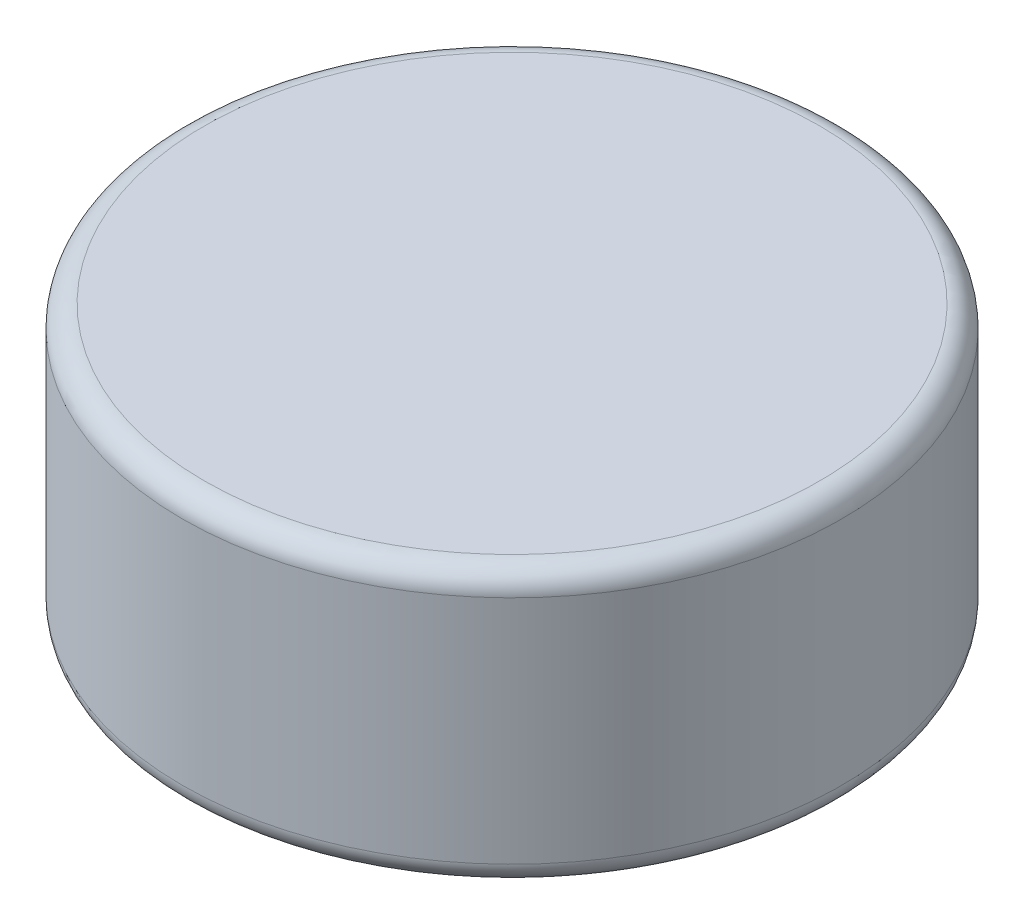
ISO-10303-21;
HEADER;
FILE_DESCRIPTION(('STEP AP214'),'2;1');
FILE_NAME('part.step','',(''),(''),'','','');
FILE_SCHEMA(('AUTOMOTIVE_DESIGN { 1 0 10303 214 1 1 1 1 }'));
ENDSEC;
DATA;
#1=APPLICATION_CONTEXT('core data for automotive mechanical design processes');
#2=APPLICATION_PROTOCOL_DEFINITION('international standard','automotive_design',2000,#1);
#3=PRODUCT_CONTEXT('',#1,'mechanical');
#4=PRODUCT('Part','Part','',(#3));
#5=PRODUCT_RELATED_PRODUCT_CATEGORY('part','',(#4));
#6=PRODUCT_DEFINITION_FORMATION('','',#4);
#7=PRODUCT_DEFINITION_CONTEXT('part definition',#1,'design');
#8=PRODUCT_DEFINITION('design','',#6,#7);
#9=PRODUCT_DEFINITION_SHAPE('','',#8);
#10=(LENGTH_UNIT() NAMED_UNIT(*) SI_UNIT(.MILLI.,.METRE.));
#11=(NAMED_UNIT(*) PLANE_ANGLE_UNIT() SI_UNIT($,.RADIAN.));
#12=(NAMED_UNIT(*) SI_UNIT($,.STERADIAN.) SOLID_ANGLE_UNIT());
#13=UNCERTAINTY_MEASURE_WITH_UNIT(LENGTH_MEASURE(1.E-05),#10,'distance_accuracy_value','');
#14=(GEOMETRIC_REPRESENTATION_CONTEXT(3) GLOBAL_UNCERTAINTY_ASSIGNED_CONTEXT((#13)) GLOBAL_UNIT_ASSIGNED_CONTEXT((#10,
#11,#12)) REPRESENTATION_CONTEXT('',''));
#15=CARTESIAN_POINT('',(0.,0.,0.));
#16=DIRECTION('',(0.,0.,1.));
#17=DIRECTION('',(1.,0.,0.));
#18=AXIS2_PLACEMENT_3D('',#15,#16,#17);
#19=CARTESIAN_POINT('',(0.,2.5,0.));
#20=DIRECTION('',(0.,-1.,0.));
#21=DIRECTION('',(0.,0.,-1.));
#22=AXIS2_PLACEMENT_3D('',#19,#20,#21);
#23=CYLINDRICAL_SURFACE('',#22,3.);
#24=CARTESIAN_POINT('',(0.,0.2,0.));
#25=DIRECTION('',(0.,1.,0.));
#26=DIRECTION('',(0.,0.,1.));
#27=AXIS2_PLACEMENT_3D('',#24,#25,#26);
#28=CIRCLE('',#27,3.);
#29=CARTESIAN_POINT('',(0.,0.2,3.));
#30=VERTEX_POINT('',#29);
#31=EDGE_CURVE('E45',#30,#30,#28,.T.);
#32=ORIENTED_EDGE('',*,*,#31,.T.);
#33=EDGE_LOOP('',(#32));
#34=FACE_BOUND('',#33,.T.);
#35=CARTESIAN_POINT('',(0.,2.3,0.));
#36=DIRECTION('',(0.,1.,0.));
#37=DIRECTION('',(0.,0.,1.));
#38=AXIS2_PLACEMENT_3D('',#35,#36,#37);
#39=CIRCLE('',#38,3.);
#40=CARTESIAN_POINT('',(0.,2.3,3.));
#41=VERTEX_POINT('',#40);
#42=EDGE_CURVE('E49',#41,#41,#39,.F.);
#43=ORIENTED_EDGE('',*,*,#42,.T.);
#44=EDGE_LOOP('',(#43));
#45=FACE_BOUND('',#44,.T.);
#46=ADVANCED_FACE('F34',(#34,#45),#23,.T.);
#47=CARTESIAN_POINT('',(0.,2.5,0.));
#48=DIRECTION('',(0.,1.,0.));
#49=DIRECTION('',(0.,0.,1.));
#50=AXIS2_PLACEMENT_3D('',#47,#48,#49);
#51=PLANE('',#50);
#52=CARTESIAN_POINT('',(0.,2.5,0.));
#53=DIRECTION('',(0.,1.,0.));
#54=DIRECTION('',(0.,0.,1.));
#55=AXIS2_PLACEMENT_3D('',#52,#53,#54);
#56=CIRCLE('',#55,2.8);
#57=CARTESIAN_POINT('',(0.,2.5,2.8));
#58=VERTEX_POINT('',#57);
#59=EDGE_CURVE('E10',#58,#58,#56,.T.);
#60=ORIENTED_EDGE('',*,*,#59,.T.);
#61=EDGE_LOOP('',(#60));
#62=FACE_BOUND('',#61,.T.);
#63=ADVANCED_FACE('F65',(#62),#51,.T.);
#64=CARTESIAN_POINT('',(0.,0.,0.));
#65=DIRECTION('',(0.,1.,0.));
#66=DIRECTION('',(0.,0.,1.));
#67=AXIS2_PLACEMENT_3D('',#64,#65,#66);
#68=PLANE('',#67);
#69=CARTESIAN_POINT('',(0.,0.,0.));
#70=DIRECTION('',(0.,1.,0.));
#71=DIRECTION('',(0.,0.,1.));
#72=AXIS2_PLACEMENT_3D('',#69,#70,#71);
#73=CIRCLE('',#72,2.8);
#74=CARTESIAN_POINT('',(0.,0.,2.8));
#75=VERTEX_POINT('',#74);
#76=EDGE_CURVE('E41',#75,#75,#73,.F.);
#77=ORIENTED_EDGE('',*,*,#76,.T.);
#78=EDGE_LOOP('',(#77));
#79=FACE_BOUND('',#78,.T.);
#80=ADVANCED_FACE('F62',(#79),#68,.F.);
#81=CARTESIAN_POINT('',(0.,0.2,0.));
#82=DIRECTION('',(0.,1.,0.));
#83=DIRECTION('',(0.,0.,1.));
#84=AXIS2_PLACEMENT_3D('',#81,#82,#83);
#85=TOROIDAL_SURFACE('',#84,2.8,0.2);
#86=ORIENTED_EDGE('',*,*,#76,.F.);
#87=EDGE_LOOP('',(#86));
#88=FACE_BOUND('',#87,.T.);
#89=ORIENTED_EDGE('',*,*,#31,.F.);
#90=EDGE_LOOP('',(#89));
#91=FACE_BOUND('',#90,.T.);
#92=ADVANCED_FACE('F58',(#88,#91),#85,.T.);
#93=CARTESIAN_POINT('',(0.,2.3,0.));
#94=DIRECTION('',(0.,1.,0.));
#95=DIRECTION('',(0.,0.,1.));
#96=AXIS2_PLACEMENT_3D('',#93,#94,#95);
#97=TOROIDAL_SURFACE('',#96,2.8,0.2);
#98=ORIENTED_EDGE('',*,*,#42,.F.);
#99=EDGE_LOOP('',(#98));
#100=FACE_BOUND('',#99,.T.);
#101=ORIENTED_EDGE('',*,*,#59,.F.);
#102=EDGE_LOOP('',(#101));
#103=FACE_BOUND('',#102,.T.);
#104=ADVANCED_FACE('F36',(#100,#103),#97,.T.);
#105=CLOSED_SHELL('',(#46,#63,#80,#92,#104));
#106=MANIFOLD_SOLID_BREP('B2',#105);
#107=ADVANCED_BREP_SHAPE_REPRESENTATION('',(#18,#106),#14);
#108=SHAPE_DEFINITION_REPRESENTATION(#9,#107);
ENDSEC;
END-ISO-10303-21;
